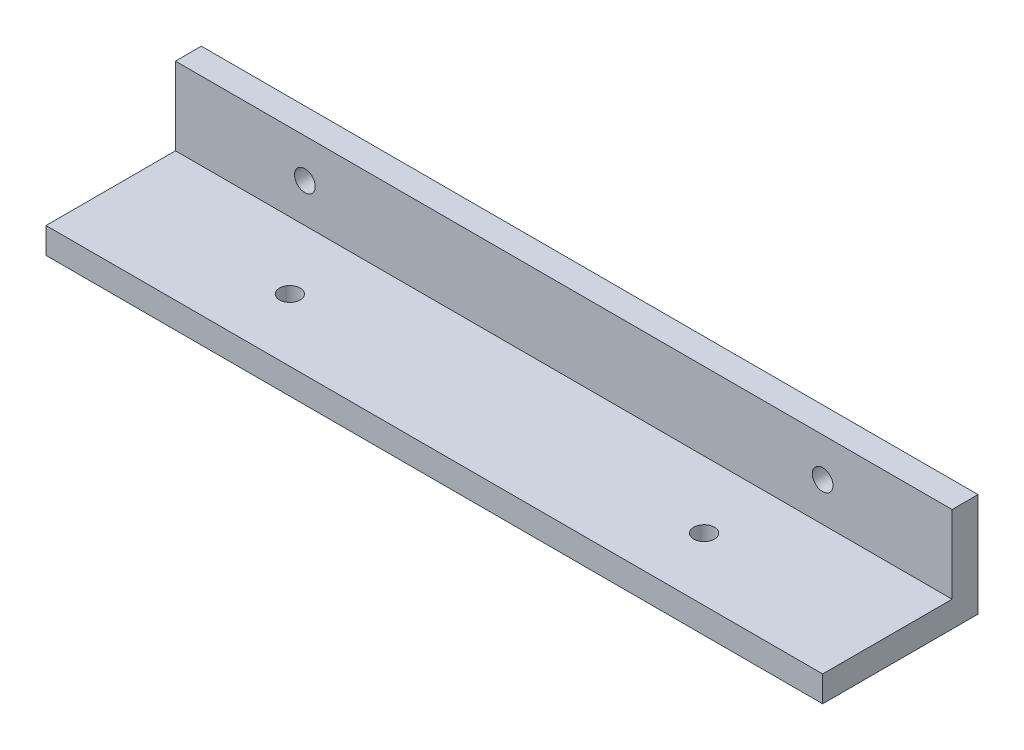
ISO-10303-21;
HEADER;
FILE_DESCRIPTION(('STEP AP214'),'2;1');
FILE_NAME('part.step','',(''),(''),'','','');
FILE_SCHEMA(('AUTOMOTIVE_DESIGN { 1 0 10303 214 1 1 1 1 }'));
ENDSEC;
DATA;
#1=APPLICATION_CONTEXT('core data for automotive mechanical design processes');
#2=APPLICATION_PROTOCOL_DEFINITION('international standard','automotive_design',2000,#1);
#3=PRODUCT_CONTEXT('',#1,'mechanical');
#4=PRODUCT('Part','Part','',(#3));
#5=PRODUCT_RELATED_PRODUCT_CATEGORY('part','',(#4));
#6=PRODUCT_DEFINITION_FORMATION('','',#4);
#7=PRODUCT_DEFINITION_CONTEXT('part definition',#1,'design');
#8=PRODUCT_DEFINITION('design','',#6,#7);
#9=PRODUCT_DEFINITION_SHAPE('','',#8);
#10=(LENGTH_UNIT() NAMED_UNIT(*) SI_UNIT(.MILLI.,.METRE.));
#11=(NAMED_UNIT(*) PLANE_ANGLE_UNIT() SI_UNIT($,.RADIAN.));
#12=(NAMED_UNIT(*) SI_UNIT($,.STERADIAN.) SOLID_ANGLE_UNIT());
#13=UNCERTAINTY_MEASURE_WITH_UNIT(LENGTH_MEASURE(1.E-05),#10,'distance_accuracy_value','');
#14=(GEOMETRIC_REPRESENTATION_CONTEXT(3) GLOBAL_UNCERTAINTY_ASSIGNED_CONTEXT((#13)) GLOBAL_UNIT_ASSIGNED_CONTEXT((#10,
#11,#12)) REPRESENTATION_CONTEXT('',''));
#15=CARTESIAN_POINT('',(0.,0.,0.));
#16=DIRECTION('',(0.,0.,1.));
#17=DIRECTION('',(1.,0.,0.));
#18=AXIS2_PLACEMENT_3D('',#15,#16,#17);
#19=CARTESIAN_POINT('',(0.,0.,0.));
#20=DIRECTION('',(0.,-1.,0.));
#21=DIRECTION('',(0.,0.,-1.));
#22=AXIS2_PLACEMENT_3D('',#19,#20,#21);
#23=PLANE('',#22);
#24=CARTESIAN_POINT('',(35.,0.,-2.1));
#25=DIRECTION('',(0.,1.,0.));
#26=DIRECTION('',(0.,0.,1.));
#27=AXIS2_PLACEMENT_3D('',#24,#25,#26);
#28=CIRCLE('',#27,2.);
#29=CARTESIAN_POINT('',(35.,0.,-0.0999999999999964));
#30=VERTEX_POINT('',#29);
#31=EDGE_CURVE('E119',#30,#30,#28,.T.);
#32=ORIENTED_EDGE('',*,*,#31,.F.);
#33=EDGE_LOOP('',(#32));
#34=FACE_BOUND('',#33,.T.);
#35=CARTESIAN_POINT('',(115.,0.,-2.1));
#36=DIRECTION('',(0.,1.,0.));
#37=DIRECTION('',(0.,0.,1.));
#38=AXIS2_PLACEMENT_3D('',#35,#36,#37);
#39=CIRCLE('',#38,2.);
#40=CARTESIAN_POINT('',(115.,0.,-0.100000000000004));
#41=VERTEX_POINT('',#40);
#42=EDGE_CURVE('E114',#41,#41,#39,.T.);
#43=ORIENTED_EDGE('',*,*,#42,.F.);
#44=EDGE_LOOP('',(#43));
#45=FACE_BOUND('',#44,.T.);
#46=DIRECTION('',(1.,0.,0.));
#47=VECTOR('',#46,1.);
#48=CARTESIAN_POINT('',(0.,0.,-15.));
#49=LINE('',#48,#47);
#50=CARTESIAN_POINT('',(0.,0.,-15.));
#51=VERTEX_POINT('',#50);
#52=CARTESIAN_POINT('',(150.,0.,-15.));
#53=VERTEX_POINT('',#52);
#54=EDGE_CURVE('E53',#51,#53,#49,.T.);
#55=ORIENTED_EDGE('',*,*,#54,.F.);
#56=DIRECTION('',(0.,0.,1.));
#57=VECTOR('',#56,1.);
#58=CARTESIAN_POINT('',(0.,0.,0.));
#59=LINE('',#58,#57);
#60=CARTESIAN_POINT('',(0.,0.,10.));
#61=VERTEX_POINT('',#60);
#62=EDGE_CURVE('E155',#51,#61,#59,.T.);
#63=ORIENTED_EDGE('',*,*,#62,.T.);
#64=DIRECTION('',(-1.,0.,0.));
#65=VECTOR('',#64,1.);
#66=CARTESIAN_POINT('',(0.,0.,10.));
#67=LINE('',#66,#65);
#68=CARTESIAN_POINT('',(150.,0.,10.));
#69=VERTEX_POINT('',#68);
#70=EDGE_CURVE('E109',#69,#61,#67,.T.);
#71=ORIENTED_EDGE('',*,*,#70,.F.);
#72=DIRECTION('',(0.,0.,-1.));
#73=VECTOR('',#72,1.);
#74=CARTESIAN_POINT('',(150.,0.,0.));
#75=LINE('',#74,#73);
#76=EDGE_CURVE('E95',#69,#53,#75,.T.);
#77=ORIENTED_EDGE('',*,*,#76,.T.);
#78=EDGE_LOOP('',(#55,#63,#71,#77));
#79=FACE_BOUND('',#78,.T.);
#80=ADVANCED_FACE('F38',(#34,#45,#79),#23,.F.);
#81=CARTESIAN_POINT('',(0.,-5.,0.));
#82=DIRECTION('',(-1.,0.,0.));
#83=DIRECTION('',(0.,0.,1.));
#84=AXIS2_PLACEMENT_3D('',#81,#82,#83);
#85=PLANE('',#84);
#86=ORIENTED_EDGE('',*,*,#62,.F.);
#87=DIRECTION('',(0.,-1.,0.));
#88=VECTOR('',#87,1.);
#89=CARTESIAN_POINT('',(0.,15.,-15.));
#90=LINE('',#89,#88);
#91=CARTESIAN_POINT('',(0.,15.,-15.));
#92=VERTEX_POINT('',#91);
#93=EDGE_CURVE('E153',#92,#51,#90,.T.);
#94=ORIENTED_EDGE('',*,*,#93,.F.);
#95=DIRECTION('',(0.,0.,1.));
#96=VECTOR('',#95,1.);
#97=CARTESIAN_POINT('',(0.,15.,-20.));
#98=LINE('',#97,#96);
#99=CARTESIAN_POINT('',(0.,15.,-20.));
#100=VERTEX_POINT('',#99);
#101=EDGE_CURVE('E138',#100,#92,#98,.T.);
#102=ORIENTED_EDGE('',*,*,#101,.F.);
#103=DIRECTION('',(0.,1.,0.));
#104=VECTOR('',#103,1.);
#105=CARTESIAN_POINT('',(0.,-5.,-20.));
#106=LINE('',#105,#104);
#107=CARTESIAN_POINT('',(0.,-5.,-20.));
#108=VERTEX_POINT('',#107);
#109=EDGE_CURVE('E11',#108,#100,#106,.T.);
#110=ORIENTED_EDGE('',*,*,#109,.F.);
#111=DIRECTION('',(0.,0.,1.));
#112=VECTOR('',#111,1.);
#113=CARTESIAN_POINT('',(0.,-5.,0.));
#114=LINE('',#113,#112);
#115=CARTESIAN_POINT('',(0.,-5.,10.));
#116=VERTEX_POINT('',#115);
#117=EDGE_CURVE('E87',#108,#116,#114,.T.);
#118=ORIENTED_EDGE('',*,*,#117,.T.);
#119=DIRECTION('',(0.,-1.,0.));
#120=VECTOR('',#119,1.);
#121=CARTESIAN_POINT('',(0.,0.,10.));
#122=LINE('',#121,#120);
#123=EDGE_CURVE('E90',#61,#116,#122,.T.);
#124=ORIENTED_EDGE('',*,*,#123,.F.);
#125=EDGE_LOOP('',(#86,#94,#102,#110,#118,#124));
#126=FACE_BOUND('',#125,.T.);
#127=ADVANCED_FACE('F40',(#126),#85,.T.);
#128=CARTESIAN_POINT('',(0.,-5.,-20.));
#129=DIRECTION('',(0.,0.,-1.));
#130=DIRECTION('',(-1.,0.,0.));
#131=AXIS2_PLACEMENT_3D('',#128,#129,#130);
#132=PLANE('',#131);
#133=CARTESIAN_POINT('',(25.,7.5,-20.));
#134=DIRECTION('',(0.,0.,1.));
#135=DIRECTION('',(1.,0.,0.));
#136=AXIS2_PLACEMENT_3D('',#133,#134,#135);
#137=CIRCLE('',#136,2.);
#138=CARTESIAN_POINT('',(27.,7.5,-20.));
#139=VERTEX_POINT('',#138);
#140=EDGE_CURVE('E127',#139,#139,#137,.T.);
#141=ORIENTED_EDGE('',*,*,#140,.T.);
#142=EDGE_LOOP('',(#141));
#143=FACE_BOUND('',#142,.T.);
#144=CARTESIAN_POINT('',(125.,7.5,-20.));
#145=DIRECTION('',(0.,0.,1.));
#146=DIRECTION('',(1.,0.,0.));
#147=AXIS2_PLACEMENT_3D('',#144,#145,#146);
#148=CIRCLE('',#147,2.);
#149=CARTESIAN_POINT('',(127.,7.5,-20.));
#150=VERTEX_POINT('',#149);
#151=EDGE_CURVE('E133',#150,#150,#148,.T.);
#152=ORIENTED_EDGE('',*,*,#151,.T.);
#153=EDGE_LOOP('',(#152));
#154=FACE_BOUND('',#153,.T.);
#155=ORIENTED_EDGE('',*,*,#109,.T.);
#156=DIRECTION('',(-1.,0.,0.));
#157=VECTOR('',#156,1.);
#158=CARTESIAN_POINT('',(0.,15.,-20.));
#159=LINE('',#158,#157);
#160=CARTESIAN_POINT('',(150.,15.,-20.));
#161=VERTEX_POINT('',#160);
#162=EDGE_CURVE('E146',#161,#100,#159,.T.);
#163=ORIENTED_EDGE('',*,*,#162,.F.);
#164=DIRECTION('',(0.,1.,0.));
#165=VECTOR('',#164,1.);
#166=CARTESIAN_POINT('',(150.,-5.,-20.));
#167=LINE('',#166,#165);
#168=CARTESIAN_POINT('',(150.,-5.,-20.));
#169=VERTEX_POINT('',#168);
#170=EDGE_CURVE('E42',#169,#161,#167,.T.);
#171=ORIENTED_EDGE('',*,*,#170,.F.);
#172=DIRECTION('',(-1.,0.,0.));
#173=VECTOR('',#172,1.);
#174=CARTESIAN_POINT('',(0.,-5.,-20.));
#175=LINE('',#174,#173);
#176=EDGE_CURVE('E158',#169,#108,#175,.T.);
#177=ORIENTED_EDGE('',*,*,#176,.T.);
#178=EDGE_LOOP('',(#155,#163,#171,#177));
#179=FACE_BOUND('',#178,.T.);
#180=ADVANCED_FACE('F172',(#143,#154,#179),#132,.T.);
#181=CARTESIAN_POINT('',(150.,-5.,0.));
#182=DIRECTION('',(1.,0.,0.));
#183=DIRECTION('',(0.,0.,-1.));
#184=AXIS2_PLACEMENT_3D('',#181,#182,#183);
#185=PLANE('',#184);
#186=ORIENTED_EDGE('',*,*,#76,.F.);
#187=DIRECTION('',(0.,1.,0.));
#188=VECTOR('',#187,1.);
#189=CARTESIAN_POINT('',(150.,0.,10.));
#190=LINE('',#189,#188);
#191=CARTESIAN_POINT('',(150.,-5.,10.));
#192=VERTEX_POINT('',#191);
#193=EDGE_CURVE('E104',#192,#69,#190,.T.);
#194=ORIENTED_EDGE('',*,*,#193,.F.);
#195=DIRECTION('',(0.,0.,-1.));
#196=VECTOR('',#195,1.);
#197=CARTESIAN_POINT('',(150.,-5.,0.));
#198=LINE('',#197,#196);
#199=EDGE_CURVE('E94',#192,#169,#198,.T.);
#200=ORIENTED_EDGE('',*,*,#199,.T.);
#201=ORIENTED_EDGE('',*,*,#170,.T.);
#202=DIRECTION('',(0.,0.,-1.));
#203=VECTOR('',#202,1.);
#204=CARTESIAN_POINT('',(150.,15.,-20.));
#205=LINE('',#204,#203);
#206=CARTESIAN_POINT('',(150.,15.,-15.));
#207=VERTEX_POINT('',#206);
#208=EDGE_CURVE('E143',#207,#161,#205,.T.);
#209=ORIENTED_EDGE('',*,*,#208,.F.);
#210=DIRECTION('',(0.,-1.,0.));
#211=VECTOR('',#210,1.);
#212=CARTESIAN_POINT('',(150.,15.,-15.));
#213=LINE('',#212,#211);
#214=EDGE_CURVE('E149',#207,#53,#213,.T.);
#215=ORIENTED_EDGE('',*,*,#214,.T.);
#216=EDGE_LOOP('',(#186,#194,#200,#201,#209,#215));
#217=FACE_BOUND('',#216,.T.);
#218=ADVANCED_FACE('F167',(#217),#185,.T.);
#219=CARTESIAN_POINT('',(0.,-5.,0.));
#220=DIRECTION('',(0.,-1.,0.));
#221=DIRECTION('',(0.,0.,-1.));
#222=AXIS2_PLACEMENT_3D('',#219,#220,#221);
#223=PLANE('',#222);
#224=CARTESIAN_POINT('',(35.,-5.,-2.1));
#225=DIRECTION('',(0.,1.,0.));
#226=DIRECTION('',(0.,0.,1.));
#227=AXIS2_PLACEMENT_3D('',#224,#225,#226);
#228=CIRCLE('',#227,2.);
#229=CARTESIAN_POINT('',(35.,-5.,-0.0999999999999964));
#230=VERTEX_POINT('',#229);
#231=EDGE_CURVE('E115',#230,#230,#228,.T.);
#232=ORIENTED_EDGE('',*,*,#231,.T.);
#233=EDGE_LOOP('',(#232));
#234=FACE_BOUND('',#233,.T.);
#235=CARTESIAN_POINT('',(115.,-5.,-2.1));
#236=DIRECTION('',(0.,1.,0.));
#237=DIRECTION('',(0.,0.,1.));
#238=AXIS2_PLACEMENT_3D('',#235,#236,#237);
#239=CIRCLE('',#238,2.);
#240=CARTESIAN_POINT('',(115.,-5.,-0.100000000000004));
#241=VERTEX_POINT('',#240);
#242=EDGE_CURVE('E122',#241,#241,#239,.T.);
#243=ORIENTED_EDGE('',*,*,#242,.T.);
#244=EDGE_LOOP('',(#243));
#245=FACE_BOUND('',#244,.T.);
#246=ORIENTED_EDGE('',*,*,#117,.F.);
#247=ORIENTED_EDGE('',*,*,#176,.F.);
#248=ORIENTED_EDGE('',*,*,#199,.F.);
#249=DIRECTION('',(1.,0.,0.));
#250=VECTOR('',#249,1.);
#251=CARTESIAN_POINT('',(0.,-5.,10.));
#252=LINE('',#251,#250);
#253=EDGE_CURVE('E98',#116,#192,#252,.T.);
#254=ORIENTED_EDGE('',*,*,#253,.F.);
#255=EDGE_LOOP('',(#246,#247,#248,#254));
#256=FACE_BOUND('',#255,.T.);
#257=ADVANCED_FACE('F99',(#234,#245,#256),#223,.T.);
#258=CARTESIAN_POINT('',(0.,15.,-15.));
#259=DIRECTION('',(0.,0.,-1.));
#260=DIRECTION('',(-1.,0.,0.));
#261=AXIS2_PLACEMENT_3D('',#258,#259,#260);
#262=PLANE('',#261);
#263=CARTESIAN_POINT('',(25.,7.5,-15.));
#264=DIRECTION('',(0.,0.,1.));
#265=DIRECTION('',(1.,0.,0.));
#266=AXIS2_PLACEMENT_3D('',#263,#264,#265);
#267=CIRCLE('',#266,2.);
#268=CARTESIAN_POINT('',(27.,7.5,-15.));
#269=VERTEX_POINT('',#268);
#270=EDGE_CURVE('E130',#269,#269,#267,.T.);
#271=ORIENTED_EDGE('',*,*,#270,.F.);
#272=EDGE_LOOP('',(#271));
#273=FACE_BOUND('',#272,.T.);
#274=CARTESIAN_POINT('',(125.,7.5,-15.));
#275=DIRECTION('',(0.,0.,1.));
#276=DIRECTION('',(1.,0.,0.));
#277=AXIS2_PLACEMENT_3D('',#274,#275,#276);
#278=CIRCLE('',#277,2.);
#279=CARTESIAN_POINT('',(127.,7.5,-15.));
#280=VERTEX_POINT('',#279);
#281=EDGE_CURVE('E118',#280,#280,#278,.T.);
#282=ORIENTED_EDGE('',*,*,#281,.F.);
#283=EDGE_LOOP('',(#282));
#284=FACE_BOUND('',#283,.T.);
#285=ORIENTED_EDGE('',*,*,#54,.T.);
#286=ORIENTED_EDGE('',*,*,#214,.F.);
#287=DIRECTION('',(1.,0.,0.));
#288=VECTOR('',#287,1.);
#289=CARTESIAN_POINT('',(0.,15.,-15.));
#290=LINE('',#289,#288);
#291=EDGE_CURVE('E141',#92,#207,#290,.T.);
#292=ORIENTED_EDGE('',*,*,#291,.F.);
#293=ORIENTED_EDGE('',*,*,#93,.T.);
#294=EDGE_LOOP('',(#285,#286,#292,#293));
#295=FACE_BOUND('',#294,.T.);
#296=ADVANCED_FACE('F164',(#273,#284,#295),#262,.F.);
#297=CARTESIAN_POINT('',(0.,15.,0.));
#298=DIRECTION('',(0.,1.,0.));
#299=DIRECTION('',(0.,0.,1.));
#300=AXIS2_PLACEMENT_3D('',#297,#298,#299);
#301=PLANE('',#300);
#302=ORIENTED_EDGE('',*,*,#101,.T.);
#303=ORIENTED_EDGE('',*,*,#291,.T.);
#304=ORIENTED_EDGE('',*,*,#208,.T.);
#305=ORIENTED_EDGE('',*,*,#162,.T.);
#306=EDGE_LOOP('',(#302,#303,#304,#305));
#307=FACE_BOUND('',#306,.T.);
#308=ADVANCED_FACE('F170',(#307),#301,.T.);
#309=CARTESIAN_POINT('',(125.,7.5,-20.));
#310=DIRECTION('',(0.,0.,1.));
#311=DIRECTION('',(1.,0.,0.));
#312=AXIS2_PLACEMENT_3D('',#309,#310,#311);
#313=CYLINDRICAL_SURFACE('',#312,2.);
#314=ORIENTED_EDGE('',*,*,#151,.F.);
#315=EDGE_LOOP('',(#314));
#316=FACE_BOUND('',#315,.T.);
#317=ORIENTED_EDGE('',*,*,#281,.T.);
#318=EDGE_LOOP('',(#317));
#319=FACE_BOUND('',#318,.T.);
#320=ADVANCED_FACE('F197',(#316,#319),#313,.F.);
#321=CARTESIAN_POINT('',(25.,7.5,-20.));
#322=DIRECTION('',(0.,0.,1.));
#323=DIRECTION('',(1.,0.,0.));
#324=AXIS2_PLACEMENT_3D('',#321,#322,#323);
#325=CYLINDRICAL_SURFACE('',#324,2.);
#326=ORIENTED_EDGE('',*,*,#140,.F.);
#327=EDGE_LOOP('',(#326));
#328=FACE_BOUND('',#327,.T.);
#329=ORIENTED_EDGE('',*,*,#270,.T.);
#330=EDGE_LOOP('',(#329));
#331=FACE_BOUND('',#330,.T.);
#332=ADVANCED_FACE('F200',(#328,#331),#325,.F.);
#333=CARTESIAN_POINT('',(115.,-5.,-2.1));
#334=DIRECTION('',(0.,1.,0.));
#335=DIRECTION('',(0.,0.,1.));
#336=AXIS2_PLACEMENT_3D('',#333,#334,#335);
#337=CYLINDRICAL_SURFACE('',#336,2.);
#338=ORIENTED_EDGE('',*,*,#242,.F.);
#339=EDGE_LOOP('',(#338));
#340=FACE_BOUND('',#339,.T.);
#341=ORIENTED_EDGE('',*,*,#42,.T.);
#342=EDGE_LOOP('',(#341));
#343=FACE_BOUND('',#342,.T.);
#344=ADVANCED_FACE('F204',(#340,#343),#337,.F.);
#345=CARTESIAN_POINT('',(35.,-5.,-2.1));
#346=DIRECTION('',(0.,1.,0.));
#347=DIRECTION('',(0.,0.,1.));
#348=AXIS2_PLACEMENT_3D('',#345,#346,#347);
#349=CYLINDRICAL_SURFACE('',#348,2.);
#350=ORIENTED_EDGE('',*,*,#231,.F.);
#351=EDGE_LOOP('',(#350));
#352=FACE_BOUND('',#351,.T.);
#353=ORIENTED_EDGE('',*,*,#31,.T.);
#354=EDGE_LOOP('',(#353));
#355=FACE_BOUND('',#354,.T.);
#356=ADVANCED_FACE('F208',(#352,#355),#349,.F.);
#357=CARTESIAN_POINT('',(0.,0.,10.));
#358=DIRECTION('',(0.,0.,1.));
#359=DIRECTION('',(1.,0.,0.));
#360=AXIS2_PLACEMENT_3D('',#357,#358,#359);
#361=PLANE('',#360);
#362=ORIENTED_EDGE('',*,*,#123,.T.);
#363=ORIENTED_EDGE('',*,*,#253,.T.);
#364=ORIENTED_EDGE('',*,*,#193,.T.);
#365=ORIENTED_EDGE('',*,*,#70,.T.);
#366=EDGE_LOOP('',(#362,#363,#364,#365));
#367=FACE_BOUND('',#366,.T.);
#368=ADVANCED_FACE('F107',(#367),#361,.T.);
#369=CLOSED_SHELL('',(#80,#127,#180,#218,#257,#296,#308,#320,#332,#344,#356,#368));
#370=MANIFOLD_SOLID_BREP('B2',#369);
#371=ADVANCED_BREP_SHAPE_REPRESENTATION('',(#18,#370),#14);
#372=SHAPE_DEFINITION_REPRESENTATION(#9,#371);
ENDSEC;
END-ISO-10303-21;
